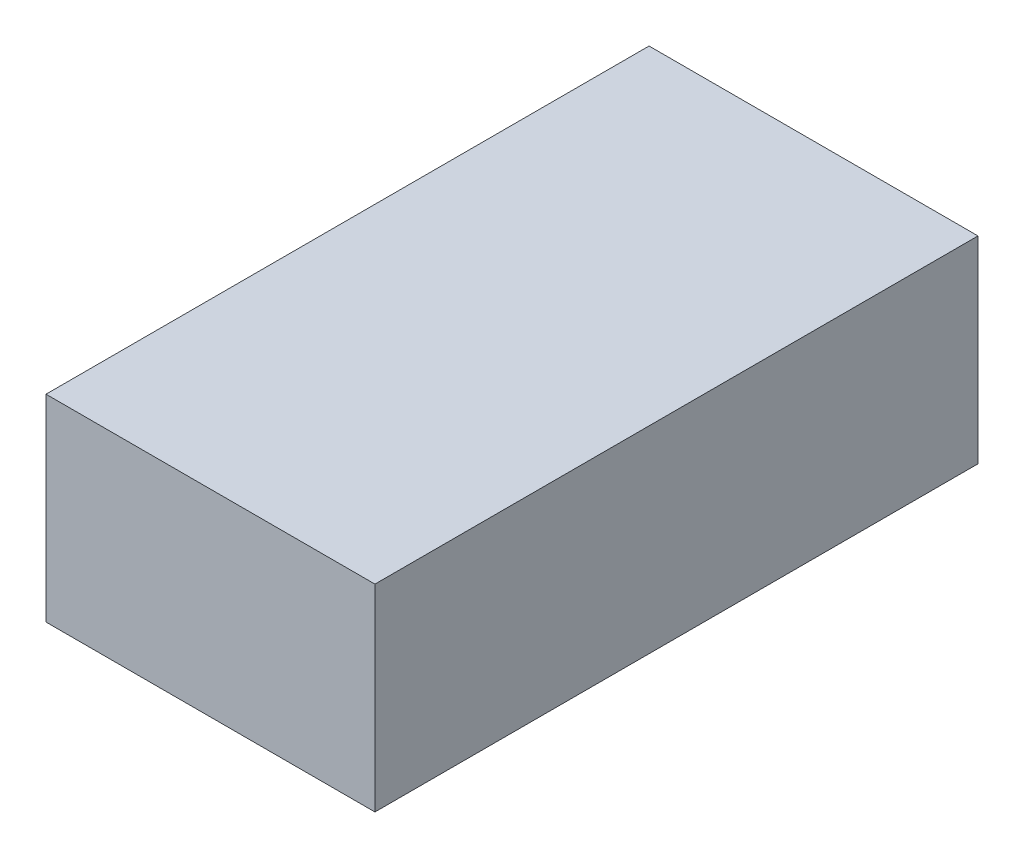
ISO-10303-21;
HEADER;
FILE_DESCRIPTION(('STEP AP214'),'2;1');
FILE_NAME('part.step','',(''),(''),'','','');
FILE_SCHEMA(('AUTOMOTIVE_DESIGN { 1 0 10303 214 1 1 1 1 }'));
ENDSEC;
DATA;
#1=APPLICATION_CONTEXT('core data for automotive mechanical design processes');
#2=APPLICATION_PROTOCOL_DEFINITION('international standard','automotive_design',2000,#1);
#3=PRODUCT_CONTEXT('',#1,'mechanical');
#4=PRODUCT('Part','Part','',(#3));
#5=PRODUCT_RELATED_PRODUCT_CATEGORY('part','',(#4));
#6=PRODUCT_DEFINITION_FORMATION('','',#4);
#7=PRODUCT_DEFINITION_CONTEXT('part definition',#1,'design');
#8=PRODUCT_DEFINITION('design','',#6,#7);
#9=PRODUCT_DEFINITION_SHAPE('','',#8);
#10=(LENGTH_UNIT() NAMED_UNIT(*) SI_UNIT(.MILLI.,.METRE.));
#11=(NAMED_UNIT(*) PLANE_ANGLE_UNIT() SI_UNIT($,.RADIAN.));
#12=(NAMED_UNIT(*) SI_UNIT($,.STERADIAN.) SOLID_ANGLE_UNIT());
#13=UNCERTAINTY_MEASURE_WITH_UNIT(LENGTH_MEASURE(1.E-05),#10,'distance_accuracy_value','');
#14=(GEOMETRIC_REPRESENTATION_CONTEXT(3) GLOBAL_UNCERTAINTY_ASSIGNED_CONTEXT((#13)) GLOBAL_UNIT_ASSIGNED_CONTEXT((#10,
#11,#12)) REPRESENTATION_CONTEXT('',''));
#15=CARTESIAN_POINT('',(0.,0.,0.));
#16=DIRECTION('',(0.,0.,1.));
#17=DIRECTION('',(1.,0.,0.));
#18=AXIS2_PLACEMENT_3D('',#15,#16,#17);
#19=CARTESIAN_POINT('',(15.,18.,27.5));
#20=DIRECTION('',(-1.,0.,0.));
#21=DIRECTION('',(0.,0.,1.));
#22=AXIS2_PLACEMENT_3D('',#19,#20,#21);
#23=PLANE('',#22);
#24=DIRECTION('',(0.,0.,-1.));
#25=VECTOR('',#24,1.);
#26=CARTESIAN_POINT('',(15.,0.,27.5));
#27=LINE('',#26,#25);
#28=CARTESIAN_POINT('',(15.,0.,27.5));
#29=VERTEX_POINT('',#28);
#30=CARTESIAN_POINT('',(15.,0.,-27.5));
#31=VERTEX_POINT('',#30);
#32=EDGE_CURVE('E98',#29,#31,#27,.T.);
#33=ORIENTED_EDGE('',*,*,#32,.T.);
#34=DIRECTION('',(0.,-1.,0.));
#35=VECTOR('',#34,1.);
#36=CARTESIAN_POINT('',(15.,18.,-27.5));
#37=LINE('',#36,#35);
#38=CARTESIAN_POINT('',(15.,18.,-27.5));
#39=VERTEX_POINT('',#38);
#40=EDGE_CURVE('E11',#39,#31,#37,.T.);
#41=ORIENTED_EDGE('',*,*,#40,.F.);
#42=DIRECTION('',(0.,0.,-1.));
#43=VECTOR('',#42,1.);
#44=CARTESIAN_POINT('',(15.,18.,27.5));
#45=LINE('',#44,#43);
#46=CARTESIAN_POINT('',(15.,18.,27.5));
#47=VERTEX_POINT('',#46);
#48=EDGE_CURVE('E86',#47,#39,#45,.T.);
#49=ORIENTED_EDGE('',*,*,#48,.F.);
#50=DIRECTION('',(0.,-1.,0.));
#51=VECTOR('',#50,1.);
#52=CARTESIAN_POINT('',(15.,18.,27.5));
#53=LINE('',#52,#51);
#54=EDGE_CURVE('E94',#47,#29,#53,.T.);
#55=ORIENTED_EDGE('',*,*,#54,.T.);
#56=EDGE_LOOP('',(#33,#41,#49,#55));
#57=FACE_BOUND('',#56,.T.);
#58=ADVANCED_FACE('F35',(#57),#23,.F.);
#59=CARTESIAN_POINT('',(-15.,18.,-27.5));
#60=DIRECTION('',(0.,0.,1.));
#61=DIRECTION('',(1.,0.,0.));
#62=AXIS2_PLACEMENT_3D('',#59,#60,#61);
#63=PLANE('',#62);
#64=DIRECTION('',(-1.,0.,0.));
#65=VECTOR('',#64,1.);
#66=CARTESIAN_POINT('',(-15.,0.,-27.5));
#67=LINE('',#66,#65);
#68=CARTESIAN_POINT('',(-15.,0.,-27.5));
#69=VERTEX_POINT('',#68);
#70=EDGE_CURVE('E90',#31,#69,#67,.T.);
#71=ORIENTED_EDGE('',*,*,#70,.T.);
#72=DIRECTION('',(0.,-1.,0.));
#73=VECTOR('',#72,1.);
#74=CARTESIAN_POINT('',(-15.,18.,-27.5));
#75=LINE('',#74,#73);
#76=CARTESIAN_POINT('',(-15.,18.,-27.5));
#77=VERTEX_POINT('',#76);
#78=EDGE_CURVE('E43',#77,#69,#75,.T.);
#79=ORIENTED_EDGE('',*,*,#78,.F.);
#80=DIRECTION('',(-1.,0.,0.));
#81=VECTOR('',#80,1.);
#82=CARTESIAN_POINT('',(-15.,18.,-27.5));
#83=LINE('',#82,#81);
#84=EDGE_CURVE('E81',#39,#77,#83,.T.);
#85=ORIENTED_EDGE('',*,*,#84,.F.);
#86=ORIENTED_EDGE('',*,*,#40,.T.);
#87=EDGE_LOOP('',(#71,#79,#85,#86));
#88=FACE_BOUND('',#87,.T.);
#89=ADVANCED_FACE('F89',(#88),#63,.F.);
#90=CARTESIAN_POINT('',(-15.,18.,27.5));
#91=DIRECTION('',(1.,0.,0.));
#92=DIRECTION('',(0.,0.,-1.));
#93=AXIS2_PLACEMENT_3D('',#90,#91,#92);
#94=PLANE('',#93);
#95=DIRECTION('',(0.,0.,1.));
#96=VECTOR('',#95,1.);
#97=CARTESIAN_POINT('',(-15.,0.,27.5));
#98=LINE('',#97,#96);
#99=CARTESIAN_POINT('',(-15.,0.,27.5));
#100=VERTEX_POINT('',#99);
#101=EDGE_CURVE('E68',#69,#100,#98,.T.);
#102=ORIENTED_EDGE('',*,*,#101,.T.);
#103=DIRECTION('',(0.,-1.,0.));
#104=VECTOR('',#103,1.);
#105=CARTESIAN_POINT('',(-15.,18.,27.5));
#106=LINE('',#105,#104);
#107=CARTESIAN_POINT('',(-15.,18.,27.5));
#108=VERTEX_POINT('',#107);
#109=EDGE_CURVE('E91',#108,#100,#106,.T.);
#110=ORIENTED_EDGE('',*,*,#109,.F.);
#111=DIRECTION('',(0.,0.,1.));
#112=VECTOR('',#111,1.);
#113=CARTESIAN_POINT('',(-15.,18.,27.5));
#114=LINE('',#113,#112);
#115=EDGE_CURVE('E84',#77,#108,#114,.T.);
#116=ORIENTED_EDGE('',*,*,#115,.F.);
#117=ORIENTED_EDGE('',*,*,#78,.T.);
#118=EDGE_LOOP('',(#102,#110,#116,#117));
#119=FACE_BOUND('',#118,.T.);
#120=ADVANCED_FACE('F92',(#119),#94,.F.);
#121=CARTESIAN_POINT('',(-15.,18.,27.5));
#122=DIRECTION('',(0.,0.,-1.));
#123=DIRECTION('',(-1.,0.,0.));
#124=AXIS2_PLACEMENT_3D('',#121,#122,#123);
#125=PLANE('',#124);
#126=DIRECTION('',(1.,0.,0.));
#127=VECTOR('',#126,1.);
#128=CARTESIAN_POINT('',(-15.,0.,27.5));
#129=LINE('',#128,#127);
#130=EDGE_CURVE('E74',#100,#29,#129,.T.);
#131=ORIENTED_EDGE('',*,*,#130,.T.);
#132=ORIENTED_EDGE('',*,*,#54,.F.);
#133=DIRECTION('',(1.,0.,0.));
#134=VECTOR('',#133,1.);
#135=CARTESIAN_POINT('',(-15.,18.,27.5));
#136=LINE('',#135,#134);
#137=EDGE_CURVE('E51',#108,#47,#136,.T.);
#138=ORIENTED_EDGE('',*,*,#137,.F.);
#139=ORIENTED_EDGE('',*,*,#109,.T.);
#140=EDGE_LOOP('',(#131,#132,#138,#139));
#141=FACE_BOUND('',#140,.T.);
#142=ADVANCED_FACE('F105',(#141),#125,.F.);
#143=CARTESIAN_POINT('',(0.,18.,0.));
#144=DIRECTION('',(0.,-1.,0.));
#145=DIRECTION('',(0.,0.,-1.));
#146=AXIS2_PLACEMENT_3D('',#143,#144,#145);
#147=PLANE('',#146);
#148=ORIENTED_EDGE('',*,*,#48,.T.);
#149=ORIENTED_EDGE('',*,*,#84,.T.);
#150=ORIENTED_EDGE('',*,*,#115,.T.);
#151=ORIENTED_EDGE('',*,*,#137,.T.);
#152=EDGE_LOOP('',(#148,#149,#150,#151));
#153=FACE_BOUND('',#152,.T.);
#154=ADVANCED_FACE('F82',(#153),#147,.F.);
#155=CARTESIAN_POINT('',(0.,0.,0.));
#156=DIRECTION('',(0.,-1.,0.));
#157=DIRECTION('',(0.,0.,-1.));
#158=AXIS2_PLACEMENT_3D('',#155,#156,#157);
#159=PLANE('',#158);
#160=ORIENTED_EDGE('',*,*,#32,.F.);
#161=ORIENTED_EDGE('',*,*,#130,.F.);
#162=ORIENTED_EDGE('',*,*,#101,.F.);
#163=ORIENTED_EDGE('',*,*,#70,.F.);
#164=EDGE_LOOP('',(#160,#161,#162,#163));
#165=FACE_BOUND('',#164,.T.);
#166=ADVANCED_FACE('F108',(#165),#159,.T.);
#167=CLOSED_SHELL('',(#58,#89,#120,#142,#154,#166));
#168=MANIFOLD_SOLID_BREP('B2',#167);
#169=ADVANCED_BREP_SHAPE_REPRESENTATION('',(#18,#168),#14);
#170=SHAPE_DEFINITION_REPRESENTATION(#9,#169);
ENDSEC;
END-ISO-10303-21;
